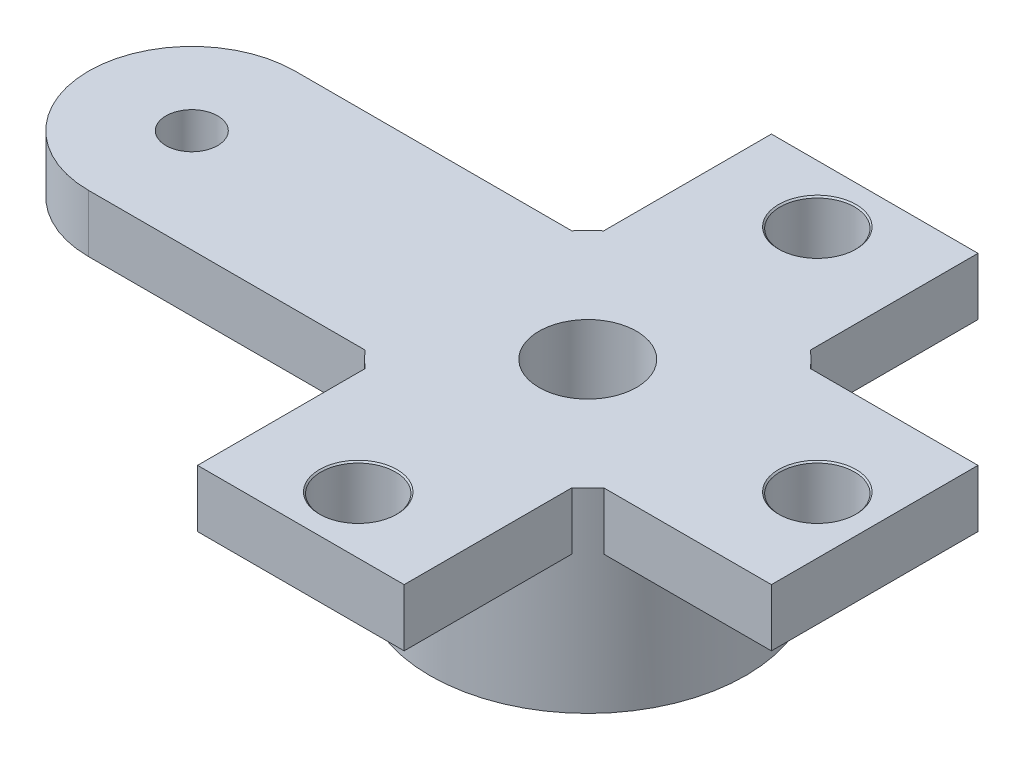
ISO-10303-21;
HEADER;
FILE_DESCRIPTION(('STEP AP214'),'2;1');
FILE_NAME('part.step','',(''),(''),'','','');
FILE_SCHEMA(('AUTOMOTIVE_DESIGN { 1 0 10303 214 1 1 1 1 }'));
ENDSEC;
DATA;
#1=APPLICATION_CONTEXT('core data for automotive mechanical design processes');
#2=APPLICATION_PROTOCOL_DEFINITION('international standard','automotive_design',2000,#1);
#3=PRODUCT_CONTEXT('',#1,'mechanical');
#4=PRODUCT('Part','Part','',(#3));
#5=PRODUCT_RELATED_PRODUCT_CATEGORY('part','',(#4));
#6=PRODUCT_DEFINITION_FORMATION('','',#4);
#7=PRODUCT_DEFINITION_CONTEXT('part definition',#1,'design');
#8=PRODUCT_DEFINITION('design','',#6,#7);
#9=PRODUCT_DEFINITION_SHAPE('','',#8);
#10=(LENGTH_UNIT() NAMED_UNIT(*) SI_UNIT(.MILLI.,.METRE.));
#11=(NAMED_UNIT(*) PLANE_ANGLE_UNIT() SI_UNIT($,.RADIAN.));
#12=(NAMED_UNIT(*) SI_UNIT($,.STERADIAN.) SOLID_ANGLE_UNIT());
#13=UNCERTAINTY_MEASURE_WITH_UNIT(LENGTH_MEASURE(1.E-05),#10,'distance_accuracy_value','');
#14=(GEOMETRIC_REPRESENTATION_CONTEXT(3) GLOBAL_UNCERTAINTY_ASSIGNED_CONTEXT((#13)) GLOBAL_UNIT_ASSIGNED_CONTEXT((#10,
#11,#12)) REPRESENTATION_CONTEXT('',''));
#15=CARTESIAN_POINT('',(0.,0.,0.));
#16=DIRECTION('',(0.,0.,1.));
#17=DIRECTION('',(1.,0.,0.));
#18=AXIS2_PLACEMENT_3D('',#15,#16,#17);
#19=CARTESIAN_POINT('',(-15.9700648039418,2.4,0.481972388439719));
#20=DIRECTION('',(0.,1.,0.));
#21=DIRECTION('',(0.,0.,1.));
#22=AXIS2_PLACEMENT_3D('',#19,#20,#21);
#23=PLANE('',#22);
#24=DIRECTION('',(0.,0.,-1.));
#25=VECTOR('',#24,1.);
#26=CARTESIAN_POINT('',(-1.79999999999997,2.4,0.481972388439679));
#27=LINE('',#26,#25);
#28=CARTESIAN_POINT('',(-1.79999999999998,2.4,-2.0790622886292));
#29=VERTEX_POINT('',#28);
#30=CARTESIAN_POINT('',(-1.79999999999999,2.4,-5.));
#31=VERTEX_POINT('',#30);
#32=EDGE_CURVE('E168',#29,#31,#27,.T.);
#33=ORIENTED_EDGE('',*,*,#32,.T.);
#34=DIRECTION('',(1.,0.,0.));
#35=VECTOR('',#34,1.);
#36=CARTESIAN_POINT('',(-15.9700648039418,2.4,-5.));
#37=LINE('',#36,#35);
#38=CARTESIAN_POINT('',(1.80000000000001,2.4,-5.));
#39=VERTEX_POINT('',#38);
#40=EDGE_CURVE('E11',#31,#39,#37,.T.);
#41=ORIENTED_EDGE('',*,*,#40,.T.);
#42=DIRECTION('',(0.,0.,-1.));
#43=VECTOR('',#42,1.);
#44=CARTESIAN_POINT('',(1.80000000000003,2.4,0.481972388439667));
#45=LINE('',#44,#43);
#46=CARTESIAN_POINT('',(1.80000000000002,2.4,-2.07906228862916));
#47=VERTEX_POINT('',#46);
#48=EDGE_CURVE('E165',#47,#39,#45,.T.);
#49=ORIENTED_EDGE('',*,*,#48,.F.);
#50=CARTESIAN_POINT('',(0.,2.4,0.));
#51=DIRECTION('',(0.,1.,0.));
#52=DIRECTION('',(0.,0.,1.));
#53=AXIS2_PLACEMENT_3D('',#50,#51,#52);
#54=CIRCLE('',#53,2.75);
#55=EDGE_CURVE('E179',#47,#29,#54,.T.);
#56=ORIENTED_EDGE('',*,*,#55,.T.);
#57=EDGE_LOOP('',(#33,#41,#49,#56));
#58=FACE_BOUND('',#57,.T.);
#59=CARTESIAN_POINT('',(0.,2.4,-4.));
#60=DIRECTION('',(0.,-1.,0.));
#61=DIRECTION('',(0.,0.,-1.));
#62=AXIS2_PLACEMENT_3D('',#59,#60,#61);
#63=CIRCLE('',#62,0.675);
#64=CARTESIAN_POINT('',(0.,2.4,-4.675));
#65=VERTEX_POINT('',#64);
#66=EDGE_CURVE('E352',#65,#65,#63,.T.);
#67=ORIENTED_EDGE('',*,*,#66,.F.);
#68=EDGE_LOOP('',(#67));
#69=FACE_BOUND('',#68,.T.);
#70=ADVANCED_FACE('F33',(#58,#69),#23,.F.);
#71=CARTESIAN_POINT('',(-15.9700648039418,2.4,0.481972388439719));
#72=DIRECTION('',(0.,1.,0.));
#73=DIRECTION('',(0.,0.,1.));
#74=AXIS2_PLACEMENT_3D('',#71,#72,#73);
#75=PLANE('',#74);
#76=DIRECTION('',(1.,0.,0.));
#77=VECTOR('',#76,1.);
#78=CARTESIAN_POINT('',(-15.9700648039418,2.4,-1.8));
#79=LINE('',#78,#77);
#80=CARTESIAN_POINT('',(2.07906228862918,2.4,-1.8));
#81=VERTEX_POINT('',#80);
#82=CARTESIAN_POINT('',(5.,2.4,-1.8));
#83=VERTEX_POINT('',#82);
#84=EDGE_CURVE('E267',#81,#83,#79,.T.);
#85=ORIENTED_EDGE('',*,*,#84,.T.);
#86=DIRECTION('',(0.,0.,1.));
#87=VECTOR('',#86,1.);
#88=CARTESIAN_POINT('',(5.,2.4,0.481972388439714));
#89=LINE('',#88,#87);
#90=CARTESIAN_POINT('',(5.,2.4,1.8));
#91=VERTEX_POINT('',#90);
#92=EDGE_CURVE('E224',#83,#91,#89,.T.);
#93=ORIENTED_EDGE('',*,*,#92,.T.);
#94=DIRECTION('',(1.,0.,0.));
#95=VECTOR('',#94,1.);
#96=CARTESIAN_POINT('',(-15.9700648039418,2.4,1.8));
#97=LINE('',#96,#95);
#98=CARTESIAN_POINT('',(2.07906228862918,2.4,1.8));
#99=VERTEX_POINT('',#98);
#100=EDGE_CURVE('E264',#99,#91,#97,.T.);
#101=ORIENTED_EDGE('',*,*,#100,.F.);
#102=CARTESIAN_POINT('',(0.,2.4,0.));
#103=DIRECTION('',(0.,1.,0.));
#104=DIRECTION('',(0.,0.,1.));
#105=AXIS2_PLACEMENT_3D('',#102,#103,#104);
#106=CIRCLE('',#105,2.75);
#107=EDGE_CURVE('E271',#99,#81,#106,.T.);
#108=ORIENTED_EDGE('',*,*,#107,.T.);
#109=EDGE_LOOP('',(#85,#93,#101,#108));
#110=FACE_BOUND('',#109,.T.);
#111=CARTESIAN_POINT('',(4.,2.4,0.));
#112=DIRECTION('',(0.,-1.,0.));
#113=DIRECTION('',(0.,0.,-1.));
#114=AXIS2_PLACEMENT_3D('',#111,#112,#113);
#115=CIRCLE('',#114,0.675);
#116=CARTESIAN_POINT('',(4.,2.4,-0.675));
#117=VERTEX_POINT('',#116);
#118=EDGE_CURVE('E340',#117,#117,#115,.T.);
#119=ORIENTED_EDGE('',*,*,#118,.F.);
#120=EDGE_LOOP('',(#119));
#121=FACE_BOUND('',#120,.T.);
#122=ADVANCED_FACE('F307',(#110,#121),#75,.F.);
#123=CARTESIAN_POINT('',(-15.9700648039418,2.4,0.481972388439719));
#124=DIRECTION('',(0.,1.,0.));
#125=DIRECTION('',(0.,0.,1.));
#126=AXIS2_PLACEMENT_3D('',#123,#124,#125);
#127=PLANE('',#126);
#128=DIRECTION('',(0.,0.,1.));
#129=VECTOR('',#128,1.);
#130=CARTESIAN_POINT('',(1.79999999999999,2.4,0.48197238843972));
#131=LINE('',#130,#129);
#132=CARTESIAN_POINT('',(1.79999999999999,2.4,2.07906228862919));
#133=VERTEX_POINT('',#132);
#134=CARTESIAN_POINT('',(1.79999999999999,2.4,4.99999999999999));
#135=VERTEX_POINT('',#134);
#136=EDGE_CURVE('E239',#133,#135,#131,.T.);
#137=ORIENTED_EDGE('',*,*,#136,.T.);
#138=DIRECTION('',(-1.,0.,0.));
#139=VECTOR('',#138,1.);
#140=CARTESIAN_POINT('',(-15.9700648039418,2.4,4.99999999999999));
#141=LINE('',#140,#139);
#142=CARTESIAN_POINT('',(-1.80000000000001,2.4,4.99999999999999));
#143=VERTEX_POINT('',#142);
#144=EDGE_CURVE('E41',#135,#143,#141,.T.);
#145=ORIENTED_EDGE('',*,*,#144,.T.);
#146=DIRECTION('',(0.,0.,1.));
#147=VECTOR('',#146,1.);
#148=CARTESIAN_POINT('',(-1.8,2.4,0.481972388439737));
#149=LINE('',#148,#147);
#150=CARTESIAN_POINT('',(-1.8,2.4,2.07906228862918));
#151=VERTEX_POINT('',#150);
#152=EDGE_CURVE('E237',#151,#143,#149,.T.);
#153=ORIENTED_EDGE('',*,*,#152,.F.);
#154=CARTESIAN_POINT('',(0.,2.4,0.));
#155=DIRECTION('',(0.,1.,0.));
#156=DIRECTION('',(0.,0.,1.));
#157=AXIS2_PLACEMENT_3D('',#154,#155,#156);
#158=CIRCLE('',#157,2.75);
#159=EDGE_CURVE('E248',#151,#133,#158,.T.);
#160=ORIENTED_EDGE('',*,*,#159,.T.);
#161=EDGE_LOOP('',(#137,#145,#153,#160));
#162=FACE_BOUND('',#161,.T.);
#163=CARTESIAN_POINT('',(0.,2.4,4.));
#164=DIRECTION('',(0.,-1.,0.));
#165=DIRECTION('',(0.,0.,-1.));
#166=AXIS2_PLACEMENT_3D('',#163,#164,#165);
#167=CIRCLE('',#166,0.675);
#168=CARTESIAN_POINT('',(0.,2.4,3.325));
#169=VERTEX_POINT('',#168);
#170=EDGE_CURVE('E328',#169,#169,#167,.T.);
#171=ORIENTED_EDGE('',*,*,#170,.F.);
#172=EDGE_LOOP('',(#171));
#173=FACE_BOUND('',#172,.T.);
#174=ADVANCED_FACE('F234',(#162,#173),#127,.F.);
#175=CARTESIAN_POINT('',(0.,3.4,0.));
#176=DIRECTION('',(0.,1.,0.));
#177=DIRECTION('',(0.,0.,1.));
#178=AXIS2_PLACEMENT_3D('',#175,#176,#177);
#179=PLANE('',#178);
#180=CARTESIAN_POINT('',(0.,3.4,-4.));
#181=DIRECTION('',(0.,-1.,0.));
#182=DIRECTION('',(0.,0.,-1.));
#183=AXIS2_PLACEMENT_3D('',#180,#181,#182);
#184=CIRCLE('',#183,0.675);
#185=CARTESIAN_POINT('',(0.,3.4,-4.675));
#186=VERTEX_POINT('',#185);
#187=EDGE_CURVE('E355',#186,#186,#184,.T.);
#188=ORIENTED_EDGE('',*,*,#187,.T.);
#189=EDGE_LOOP('',(#188));
#190=FACE_BOUND('',#189,.T.);
#191=CARTESIAN_POINT('',(4.,3.4,0.));
#192=DIRECTION('',(0.,-1.,0.));
#193=DIRECTION('',(0.,0.,-1.));
#194=AXIS2_PLACEMENT_3D('',#191,#192,#193);
#195=CIRCLE('',#194,0.674999999999999);
#196=CARTESIAN_POINT('',(4.,3.4,-0.674999999999999));
#197=VERTEX_POINT('',#196);
#198=EDGE_CURVE('E343',#197,#197,#195,.T.);
#199=ORIENTED_EDGE('',*,*,#198,.T.);
#200=EDGE_LOOP('',(#199));
#201=FACE_BOUND('',#200,.T.);
#202=CARTESIAN_POINT('',(0.,3.4,4.));
#203=DIRECTION('',(0.,-1.,0.));
#204=DIRECTION('',(0.,0.,-1.));
#205=AXIS2_PLACEMENT_3D('',#202,#203,#204);
#206=CIRCLE('',#205,0.675);
#207=CARTESIAN_POINT('',(0.,3.4,3.325));
#208=VERTEX_POINT('',#207);
#209=EDGE_CURVE('E331',#208,#208,#206,.T.);
#210=ORIENTED_EDGE('',*,*,#209,.T.);
#211=EDGE_LOOP('',(#210));
#212=FACE_BOUND('',#211,.T.);
#213=DIRECTION('',(1.,0.,0.));
#214=VECTOR('',#213,1.);
#215=CARTESIAN_POINT('',(-15.7617566147468,3.4,-5.));
#216=LINE('',#215,#214);
#217=CARTESIAN_POINT('',(-1.79999999999999,3.4,-5.));
#218=VERTEX_POINT('',#217);
#219=CARTESIAN_POINT('',(1.80000000000001,3.4,-5.));
#220=VERTEX_POINT('',#219);
#221=EDGE_CURVE('E146',#218,#220,#216,.T.);
#222=ORIENTED_EDGE('',*,*,#221,.F.);
#223=DIRECTION('',(0.,0.,-1.));
#224=VECTOR('',#223,1.);
#225=CARTESIAN_POINT('',(-1.79999999999997,3.4,0.481972388439679));
#226=LINE('',#225,#224);
#227=CARTESIAN_POINT('',(-1.79999999999998,3.4,-2.0790622886292));
#228=VERTEX_POINT('',#227);
#229=EDGE_CURVE('E156',#228,#218,#226,.T.);
#230=ORIENTED_EDGE('',*,*,#229,.F.);
#231=CARTESIAN_POINT('',(0.,3.4,0.));
#232=DIRECTION('',(0.,1.,0.));
#233=DIRECTION('',(0.,0.,1.));
#234=AXIS2_PLACEMENT_3D('',#231,#232,#233);
#235=CIRCLE('',#234,2.75);
#236=CARTESIAN_POINT('',(-2.07906228862918,3.4,-1.8));
#237=VERTEX_POINT('',#236);
#238=EDGE_CURVE('E226',#228,#237,#235,.T.);
#239=ORIENTED_EDGE('',*,*,#238,.T.);
#240=DIRECTION('',(-1.,0.,0.));
#241=VECTOR('',#240,1.);
#242=CARTESIAN_POINT('',(-15.9700648039418,3.4,-1.80000000000004));
#243=LINE('',#242,#241);
#244=CARTESIAN_POINT('',(-6.9,3.4,-1.80000000000001));
#245=VERTEX_POINT('',#244);
#246=EDGE_CURVE('E198',#237,#245,#243,.T.);
#247=ORIENTED_EDGE('',*,*,#246,.T.);
#248=CARTESIAN_POINT('',(-6.9,3.4,0.));
#249=DIRECTION('',(0.,1.,0.));
#250=DIRECTION('',(0.,0.,1.));
#251=AXIS2_PLACEMENT_3D('',#248,#249,#250);
#252=CIRCLE('',#251,1.8);
#253=CARTESIAN_POINT('',(-6.9,3.4,1.79999999999999));
#254=VERTEX_POINT('',#253);
#255=EDGE_CURVE('E201',#245,#254,#252,.T.);
#256=ORIENTED_EDGE('',*,*,#255,.T.);
#257=DIRECTION('',(-1.,0.,0.));
#258=VECTOR('',#257,1.);
#259=CARTESIAN_POINT('',(-15.9700648039418,3.4,1.79999999999999));
#260=LINE('',#259,#258);
#261=CARTESIAN_POINT('',(-2.07906228862919,3.4,1.79999999999999));
#262=VERTEX_POINT('',#261);
#263=EDGE_CURVE('E184',#262,#254,#260,.T.);
#264=ORIENTED_EDGE('',*,*,#263,.F.);
#265=CARTESIAN_POINT('',(-1.8,3.4,2.07906228862918));
#266=VERTEX_POINT('',#265);
#267=EDGE_CURVE('E221',#262,#266,#235,.T.);
#268=ORIENTED_EDGE('',*,*,#267,.T.);
#269=DIRECTION('',(0.,0.,1.));
#270=VECTOR('',#269,1.);
#271=CARTESIAN_POINT('',(-1.8,3.4,0.481972388439737));
#272=LINE('',#271,#270);
#273=CARTESIAN_POINT('',(-1.80000000000001,3.4,4.99999999999999));
#274=VERTEX_POINT('',#273);
#275=EDGE_CURVE('E251',#266,#274,#272,.T.);
#276=ORIENTED_EDGE('',*,*,#275,.T.);
#277=DIRECTION('',(-1.,0.,0.));
#278=VECTOR('',#277,1.);
#279=CARTESIAN_POINT('',(-15.7617566147468,3.4,4.99999999999999));
#280=LINE('',#279,#278);
#281=CARTESIAN_POINT('',(1.79999999999999,3.4,4.99999999999999));
#282=VERTEX_POINT('',#281);
#283=EDGE_CURVE('E319',#282,#274,#280,.T.);
#284=ORIENTED_EDGE('',*,*,#283,.F.);
#285=DIRECTION('',(0.,0.,1.));
#286=VECTOR('',#285,1.);
#287=CARTESIAN_POINT('',(1.79999999999999,3.4,0.48197238843972));
#288=LINE('',#287,#286);
#289=CARTESIAN_POINT('',(1.79999999999999,3.4,2.07906228862919));
#290=VERTEX_POINT('',#289);
#291=EDGE_CURVE('E246',#290,#282,#288,.T.);
#292=ORIENTED_EDGE('',*,*,#291,.F.);
#293=CARTESIAN_POINT('',(2.07906228862918,3.4,1.8));
#294=VERTEX_POINT('',#293);
#295=EDGE_CURVE('E225',#290,#294,#235,.T.);
#296=ORIENTED_EDGE('',*,*,#295,.T.);
#297=DIRECTION('',(1.,0.,0.));
#298=VECTOR('',#297,1.);
#299=CARTESIAN_POINT('',(-15.9700648039418,3.4,1.8));
#300=LINE('',#299,#298);
#301=CARTESIAN_POINT('',(5.,3.4,1.8));
#302=VERTEX_POINT('',#301);
#303=EDGE_CURVE('E262',#294,#302,#300,.T.);
#304=ORIENTED_EDGE('',*,*,#303,.T.);
#305=DIRECTION('',(0.,0.,1.));
#306=VECTOR('',#305,1.);
#307=CARTESIAN_POINT('',(5.,3.4,0.477252337699819));
#308=LINE('',#307,#306);
#309=CARTESIAN_POINT('',(5.,3.4,-1.8));
#310=VERTEX_POINT('',#309);
#311=EDGE_CURVE('E314',#310,#302,#308,.T.);
#312=ORIENTED_EDGE('',*,*,#311,.F.);
#313=DIRECTION('',(1.,0.,0.));
#314=VECTOR('',#313,1.);
#315=CARTESIAN_POINT('',(-15.9700648039418,3.4,-1.8));
#316=LINE('',#315,#314);
#317=CARTESIAN_POINT('',(2.07906228862918,3.4,-1.8));
#318=VERTEX_POINT('',#317);
#319=EDGE_CURVE('E268',#318,#310,#316,.T.);
#320=ORIENTED_EDGE('',*,*,#319,.F.);
#321=CARTESIAN_POINT('',(1.80000000000002,3.4,-2.07906228862916));
#322=VERTEX_POINT('',#321);
#323=EDGE_CURVE('E291',#318,#322,#235,.T.);
#324=ORIENTED_EDGE('',*,*,#323,.T.);
#325=DIRECTION('',(0.,0.,-1.));
#326=VECTOR('',#325,1.);
#327=CARTESIAN_POINT('',(1.80000000000003,3.4,0.481972388439667));
#328=LINE('',#327,#326);
#329=EDGE_CURVE('E159',#322,#220,#328,.T.);
#330=ORIENTED_EDGE('',*,*,#329,.T.);
#331=EDGE_LOOP('',(#222,#230,#239,#247,#256,#264,#268,#276,#284,#292,#296,#304,#312,#320,#324,#330));
#332=FACE_BOUND('',#331,.T.);
#333=CARTESIAN_POINT('',(0.,3.4,0.));
#334=DIRECTION('',(0.,1.,0.));
#335=DIRECTION('',(0.,0.,1.));
#336=AXIS2_PLACEMENT_3D('',#333,#334,#335);
#337=CIRCLE('',#336,0.85);
#338=CARTESIAN_POINT('',(0.,3.4,0.85));
#339=VERTEX_POINT('',#338);
#340=EDGE_CURVE('E215',#339,#339,#337,.T.);
#341=ORIENTED_EDGE('',*,*,#340,.F.);
#342=EDGE_LOOP('',(#341));
#343=FACE_BOUND('',#342,.T.);
#344=CARTESIAN_POINT('',(-6.9,3.4,0.));
#345=DIRECTION('',(0.,1.,0.));
#346=DIRECTION('',(0.,0.,1.));
#347=AXIS2_PLACEMENT_3D('',#344,#345,#346);
#348=CIRCLE('',#347,0.45);
#349=CARTESIAN_POINT('',(-6.9,3.4,0.449999999999986));
#350=VERTEX_POINT('',#349);
#351=EDGE_CURVE('E177',#350,#350,#348,.T.);
#352=ORIENTED_EDGE('',*,*,#351,.F.);
#353=EDGE_LOOP('',(#352));
#354=FACE_BOUND('',#353,.T.);
#355=ADVANCED_FACE('F154',(#190,#201,#212,#332,#343,#354),#179,.T.);
#356=CARTESIAN_POINT('',(0.,0.,0.));
#357=DIRECTION('',(0.,1.,0.));
#358=DIRECTION('',(0.,0.,1.));
#359=AXIS2_PLACEMENT_3D('',#356,#357,#358);
#360=PLANE('',#359);
#361=CARTESIAN_POINT('',(0.,0.,0.));
#362=DIRECTION('',(0.,1.,0.));
#363=DIRECTION('',(0.,0.,1.));
#364=AXIS2_PLACEMENT_3D('',#361,#362,#363);
#365=CIRCLE('',#364,2.75);
#366=CARTESIAN_POINT('',(0.,0.,2.75));
#367=VERTEX_POINT('',#366);
#368=EDGE_CURVE('E218',#367,#367,#365,.T.);
#369=ORIENTED_EDGE('',*,*,#368,.F.);
#370=EDGE_LOOP('',(#369));
#371=FACE_BOUND('',#370,.T.);
#372=CARTESIAN_POINT('',(0.,0.,0.));
#373=DIRECTION('',(0.,1.,0.));
#374=DIRECTION('',(0.,0.,1.));
#375=AXIS2_PLACEMENT_3D('',#372,#373,#374);
#376=CIRCLE('',#375,0.85);
#377=CARTESIAN_POINT('',(0.,0.,0.85));
#378=VERTEX_POINT('',#377);
#379=EDGE_CURVE('E209',#378,#378,#376,.T.);
#380=ORIENTED_EDGE('',*,*,#379,.T.);
#381=EDGE_LOOP('',(#380));
#382=FACE_BOUND('',#381,.T.);
#383=ADVANCED_FACE('F419',(#371,#382),#360,.F.);
#384=CARTESIAN_POINT('',(0.,3.4,0.));
#385=DIRECTION('',(0.,-1.,0.));
#386=DIRECTION('',(0.,0.,-1.));
#387=AXIS2_PLACEMENT_3D('',#384,#385,#386);
#388=CYLINDRICAL_SURFACE('',#387,2.75);
#389=ORIENTED_EDGE('',*,*,#159,.F.);
#390=DIRECTION('',(0.,1.,0.));
#391=VECTOR('',#390,1.);
#392=CARTESIAN_POINT('',(-1.8,2.4,2.07906228862918));
#393=LINE('',#392,#391);
#394=EDGE_CURVE('E245',#151,#266,#393,.T.);
#395=ORIENTED_EDGE('',*,*,#394,.T.);
#396=ORIENTED_EDGE('',*,*,#267,.F.);
#397=DIRECTION('',(0.,1.,0.));
#398=VECTOR('',#397,1.);
#399=CARTESIAN_POINT('',(-2.07906228862919,2.4,1.79999999999999));
#400=LINE('',#399,#398);
#401=CARTESIAN_POINT('',(-2.07906228862919,2.4,1.79999999999999));
#402=VERTEX_POINT('',#401);
#403=EDGE_CURVE('E210',#402,#262,#400,.T.);
#404=ORIENTED_EDGE('',*,*,#403,.F.);
#405=CARTESIAN_POINT('',(0.,2.4,0.));
#406=DIRECTION('',(0.,1.,0.));
#407=DIRECTION('',(0.,0.,1.));
#408=AXIS2_PLACEMENT_3D('',#405,#406,#407);
#409=CIRCLE('',#408,2.75);
#410=CARTESIAN_POINT('',(-2.07906228862918,2.4,-1.8));
#411=VERTEX_POINT('',#410);
#412=EDGE_CURVE('E192',#411,#402,#409,.T.);
#413=ORIENTED_EDGE('',*,*,#412,.F.);
#414=DIRECTION('',(0.,1.,0.));
#415=VECTOR('',#414,1.);
#416=CARTESIAN_POINT('',(-2.07906228862918,2.4,-1.8));
#417=LINE('',#416,#415);
#418=EDGE_CURVE('E206',#411,#237,#417,.T.);
#419=ORIENTED_EDGE('',*,*,#418,.T.);
#420=ORIENTED_EDGE('',*,*,#238,.F.);
#421=DIRECTION('',(0.,1.,0.));
#422=VECTOR('',#421,1.);
#423=CARTESIAN_POINT('',(-1.79999999999998,2.4,-2.0790622886292));
#424=LINE('',#423,#422);
#425=EDGE_CURVE('E164',#29,#228,#424,.T.);
#426=ORIENTED_EDGE('',*,*,#425,.F.);
#427=ORIENTED_EDGE('',*,*,#55,.F.);
#428=DIRECTION('',(0.,1.,0.));
#429=VECTOR('',#428,1.);
#430=CARTESIAN_POINT('',(1.80000000000002,2.4,-2.07906228862916));
#431=LINE('',#430,#429);
#432=EDGE_CURVE('E174',#47,#322,#431,.T.);
#433=ORIENTED_EDGE('',*,*,#432,.T.);
#434=ORIENTED_EDGE('',*,*,#323,.F.);
#435=DIRECTION('',(0.,1.,0.));
#436=VECTOR('',#435,1.);
#437=CARTESIAN_POINT('',(2.07906228862918,2.4,-1.8));
#438=LINE('',#437,#436);
#439=EDGE_CURVE('E274',#81,#318,#438,.T.);
#440=ORIENTED_EDGE('',*,*,#439,.F.);
#441=ORIENTED_EDGE('',*,*,#107,.F.);
#442=DIRECTION('',(0.,1.,0.));
#443=VECTOR('',#442,1.);
#444=CARTESIAN_POINT('',(2.07906228862918,2.4,1.8));
#445=LINE('',#444,#443);
#446=EDGE_CURVE('E170',#99,#294,#445,.T.);
#447=ORIENTED_EDGE('',*,*,#446,.T.);
#448=ORIENTED_EDGE('',*,*,#295,.F.);
#449=DIRECTION('',(0.,1.,0.));
#450=VECTOR('',#449,1.);
#451=CARTESIAN_POINT('',(1.79999999999999,2.4,2.07906228862919));
#452=LINE('',#451,#450);
#453=EDGE_CURVE('E258',#133,#290,#452,.T.);
#454=ORIENTED_EDGE('',*,*,#453,.F.);
#455=EDGE_LOOP('',(#389,#395,#396,#404,#413,#419,#420,#426,#427,#433,#434,#440,#441,#447,#448,#454));
#456=FACE_BOUND('',#455,.T.);
#457=ORIENTED_EDGE('',*,*,#368,.T.);
#458=EDGE_LOOP('',(#457));
#459=FACE_BOUND('',#458,.T.);
#460=ADVANCED_FACE('F35',(#456,#459),#388,.T.);
#461=CARTESIAN_POINT('',(0.,3.4,0.));
#462=DIRECTION('',(0.,-1.,0.));
#463=DIRECTION('',(0.,0.,-1.));
#464=AXIS2_PLACEMENT_3D('',#461,#462,#463);
#465=CYLINDRICAL_SURFACE('',#464,0.85);
#466=ORIENTED_EDGE('',*,*,#340,.T.);
#467=EDGE_LOOP('',(#466));
#468=FACE_BOUND('',#467,.T.);
#469=ORIENTED_EDGE('',*,*,#379,.F.);
#470=EDGE_LOOP('',(#469));
#471=FACE_BOUND('',#470,.T.);
#472=ADVANCED_FACE('F410',(#468,#471),#465,.F.);
#473=CARTESIAN_POINT('',(-15.9700648039418,2.4,-1.80000000000004));
#474=DIRECTION('',(0.,0.,-1.));
#475=DIRECTION('',(-1.,0.,0.));
#476=AXIS2_PLACEMENT_3D('',#473,#474,#475);
#477=PLANE('',#476);
#478=ORIENTED_EDGE('',*,*,#246,.F.);
#479=ORIENTED_EDGE('',*,*,#418,.F.);
#480=DIRECTION('',(-1.,0.,0.));
#481=VECTOR('',#480,1.);
#482=CARTESIAN_POINT('',(-15.9700648039418,2.4,-1.80000000000004));
#483=LINE('',#482,#481);
#484=CARTESIAN_POINT('',(-6.9,2.4,-1.80000000000001));
#485=VERTEX_POINT('',#484);
#486=EDGE_CURVE('E183',#411,#485,#483,.T.);
#487=ORIENTED_EDGE('',*,*,#486,.T.);
#488=DIRECTION('',(0.,1.,0.));
#489=VECTOR('',#488,1.);
#490=CARTESIAN_POINT('',(-6.9,2.4,-1.80000000000001));
#491=LINE('',#490,#489);
#492=EDGE_CURVE('E195',#485,#245,#491,.T.);
#493=ORIENTED_EDGE('',*,*,#492,.T.);
#494=EDGE_LOOP('',(#478,#479,#487,#493));
#495=FACE_BOUND('',#494,.T.);
#496=ADVANCED_FACE('F403',(#495),#477,.T.);
#497=CARTESIAN_POINT('',(-15.9700648039418,2.4,1.79999999999999));
#498=DIRECTION('',(0.,0.,-1.));
#499=DIRECTION('',(-1.,0.,0.));
#500=AXIS2_PLACEMENT_3D('',#497,#498,#499);
#501=PLANE('',#500);
#502=ORIENTED_EDGE('',*,*,#263,.T.);
#503=DIRECTION('',(0.,1.,0.));
#504=VECTOR('',#503,1.);
#505=CARTESIAN_POINT('',(-6.9,2.4,1.79999999999999));
#506=LINE('',#505,#504);
#507=CARTESIAN_POINT('',(-6.9,2.4,1.79999999999999));
#508=VERTEX_POINT('',#507);
#509=EDGE_CURVE('E212',#508,#254,#506,.T.);
#510=ORIENTED_EDGE('',*,*,#509,.F.);
#511=DIRECTION('',(-1.,0.,0.));
#512=VECTOR('',#511,1.);
#513=CARTESIAN_POINT('',(-15.9700648039418,2.4,1.79999999999999));
#514=LINE('',#513,#512);
#515=EDGE_CURVE('E190',#402,#508,#514,.T.);
#516=ORIENTED_EDGE('',*,*,#515,.F.);
#517=ORIENTED_EDGE('',*,*,#403,.T.);
#518=EDGE_LOOP('',(#502,#510,#516,#517));
#519=FACE_BOUND('',#518,.T.);
#520=ADVANCED_FACE('F399',(#519),#501,.F.);
#521=CARTESIAN_POINT('',(-6.9,2.4,0.));
#522=DIRECTION('',(0.,1.,0.));
#523=DIRECTION('',(0.,0.,1.));
#524=AXIS2_PLACEMENT_3D('',#521,#522,#523);
#525=CYLINDRICAL_SURFACE('',#524,0.45);
#526=CARTESIAN_POINT('',(-6.9,2.4,0.));
#527=DIRECTION('',(0.,1.,0.));
#528=DIRECTION('',(0.,0.,1.));
#529=AXIS2_PLACEMENT_3D('',#526,#527,#528);
#530=CIRCLE('',#529,0.45);
#531=CARTESIAN_POINT('',(-6.9,2.4,0.449999999999986));
#532=VERTEX_POINT('',#531);
#533=EDGE_CURVE('E180',#532,#532,#530,.T.);
#534=ORIENTED_EDGE('',*,*,#533,.F.);
#535=EDGE_LOOP('',(#534));
#536=FACE_BOUND('',#535,.T.);
#537=ORIENTED_EDGE('',*,*,#351,.T.);
#538=EDGE_LOOP('',(#537));
#539=FACE_BOUND('',#538,.T.);
#540=ADVANCED_FACE('F402',(#536,#539),#525,.F.);
#541=CARTESIAN_POINT('',(-6.9,2.4,0.));
#542=DIRECTION('',(0.,1.,0.));
#543=DIRECTION('',(0.,0.,1.));
#544=AXIS2_PLACEMENT_3D('',#541,#542,#543);
#545=CYLINDRICAL_SURFACE('',#544,1.8);
#546=ORIENTED_EDGE('',*,*,#255,.F.);
#547=ORIENTED_EDGE('',*,*,#492,.F.);
#548=CARTESIAN_POINT('',(-6.9,2.4,0.));
#549=DIRECTION('',(0.,1.,0.));
#550=DIRECTION('',(0.,0.,1.));
#551=AXIS2_PLACEMENT_3D('',#548,#549,#550);
#552=CIRCLE('',#551,1.8);
#553=EDGE_CURVE('E187',#485,#508,#552,.T.);
#554=ORIENTED_EDGE('',*,*,#553,.T.);
#555=ORIENTED_EDGE('',*,*,#509,.T.);
#556=EDGE_LOOP('',(#546,#547,#554,#555));
#557=FACE_BOUND('',#556,.T.);
#558=ADVANCED_FACE('F397',(#557),#545,.T.);
#559=CARTESIAN_POINT('',(-15.9700648039418,2.4,0.481972388439719));
#560=DIRECTION('',(0.,1.,0.));
#561=DIRECTION('',(0.,0.,1.));
#562=AXIS2_PLACEMENT_3D('',#559,#560,#561);
#563=PLANE('',#562);
#564=ORIENTED_EDGE('',*,*,#533,.T.);
#565=EDGE_LOOP('',(#564));
#566=FACE_BOUND('',#565,.T.);
#567=ORIENTED_EDGE('',*,*,#486,.F.);
#568=ORIENTED_EDGE('',*,*,#412,.T.);
#569=ORIENTED_EDGE('',*,*,#515,.T.);
#570=ORIENTED_EDGE('',*,*,#553,.F.);
#571=EDGE_LOOP('',(#567,#568,#569,#570));
#572=FACE_BOUND('',#571,.T.);
#573=ADVANCED_FACE('F393',(#566,#572),#563,.F.);
#574=CARTESIAN_POINT('',(1.80000000000003,2.4,0.481972388439667));
#575=DIRECTION('',(1.,0.,0.));
#576=DIRECTION('',(0.,0.,-1.));
#577=AXIS2_PLACEMENT_3D('',#574,#575,#576);
#578=PLANE('',#577);
#579=DIRECTION('',(0.,1.,0.));
#580=VECTOR('',#579,1.);
#581=CARTESIAN_POINT('',(1.80000000000001,0.,-5.));
#582=LINE('',#581,#580);
#583=EDGE_CURVE('E48',#39,#220,#582,.T.);
#584=ORIENTED_EDGE('',*,*,#583,.T.);
#585=ORIENTED_EDGE('',*,*,#329,.F.);
#586=ORIENTED_EDGE('',*,*,#432,.F.);
#587=ORIENTED_EDGE('',*,*,#48,.T.);
#588=EDGE_LOOP('',(#584,#585,#586,#587));
#589=FACE_BOUND('',#588,.T.);
#590=ADVANCED_FACE('F390',(#589),#578,.T.);
#591=CARTESIAN_POINT('',(-1.79999999999997,2.4,0.481972388439679));
#592=DIRECTION('',(1.,0.,0.));
#593=DIRECTION('',(0.,0.,-1.));
#594=AXIS2_PLACEMENT_3D('',#591,#592,#593);
#595=PLANE('',#594);
#596=ORIENTED_EDGE('',*,*,#229,.T.);
#597=DIRECTION('',(0.,1.,0.));
#598=VECTOR('',#597,1.);
#599=CARTESIAN_POINT('',(-1.79999999999999,0.,-5.));
#600=LINE('',#599,#598);
#601=EDGE_CURVE('E143',#31,#218,#600,.T.);
#602=ORIENTED_EDGE('',*,*,#601,.F.);
#603=ORIENTED_EDGE('',*,*,#32,.F.);
#604=ORIENTED_EDGE('',*,*,#425,.T.);
#605=EDGE_LOOP('',(#596,#602,#603,#604));
#606=FACE_BOUND('',#605,.T.);
#607=ADVANCED_FACE('F162',(#606),#595,.F.);
#608=CARTESIAN_POINT('',(-15.9700648039418,2.4,1.8));
#609=DIRECTION('',(0.,0.,1.));
#610=DIRECTION('',(1.,0.,0.));
#611=AXIS2_PLACEMENT_3D('',#608,#609,#610);
#612=PLANE('',#611);
#613=DIRECTION('',(0.,1.,0.));
#614=VECTOR('',#613,1.);
#615=CARTESIAN_POINT('',(5.,0.,1.8));
#616=LINE('',#615,#614);
#617=EDGE_CURVE('E259',#91,#302,#616,.T.);
#618=ORIENTED_EDGE('',*,*,#617,.T.);
#619=ORIENTED_EDGE('',*,*,#303,.F.);
#620=ORIENTED_EDGE('',*,*,#446,.F.);
#621=ORIENTED_EDGE('',*,*,#100,.T.);
#622=EDGE_LOOP('',(#618,#619,#620,#621));
#623=FACE_BOUND('',#622,.T.);
#624=ADVANCED_FACE('F302',(#623),#612,.T.);
#625=CARTESIAN_POINT('',(-15.9700648039418,2.4,-1.8));
#626=DIRECTION('',(0.,0.,1.));
#627=DIRECTION('',(1.,0.,0.));
#628=AXIS2_PLACEMENT_3D('',#625,#626,#627);
#629=PLANE('',#628);
#630=ORIENTED_EDGE('',*,*,#319,.T.);
#631=DIRECTION('',(0.,1.,0.));
#632=VECTOR('',#631,1.);
#633=CARTESIAN_POINT('',(5.,0.,-1.8));
#634=LINE('',#633,#632);
#635=EDGE_CURVE('E254',#83,#310,#634,.T.);
#636=ORIENTED_EDGE('',*,*,#635,.F.);
#637=ORIENTED_EDGE('',*,*,#84,.F.);
#638=ORIENTED_EDGE('',*,*,#439,.T.);
#639=EDGE_LOOP('',(#630,#636,#637,#638));
#640=FACE_BOUND('',#639,.T.);
#641=ADVANCED_FACE('F313',(#640),#629,.F.);
#642=CARTESIAN_POINT('',(-1.8,2.4,0.481972388439737));
#643=DIRECTION('',(-1.,0.,0.));
#644=DIRECTION('',(0.,0.,1.));
#645=AXIS2_PLACEMENT_3D('',#642,#643,#644);
#646=PLANE('',#645);
#647=DIRECTION('',(0.,1.,0.));
#648=VECTOR('',#647,1.);
#649=CARTESIAN_POINT('',(-1.80000000000001,0.,4.99999999999999));
#650=LINE('',#649,#648);
#651=EDGE_CURVE('E55',#143,#274,#650,.T.);
#652=ORIENTED_EDGE('',*,*,#651,.T.);
#653=ORIENTED_EDGE('',*,*,#275,.F.);
#654=ORIENTED_EDGE('',*,*,#394,.F.);
#655=ORIENTED_EDGE('',*,*,#152,.T.);
#656=EDGE_LOOP('',(#652,#653,#654,#655));
#657=FACE_BOUND('',#656,.T.);
#658=ADVANCED_FACE('F242',(#657),#646,.T.);
#659=CARTESIAN_POINT('',(1.79999999999999,2.4,0.48197238843972));
#660=DIRECTION('',(-1.,0.,0.));
#661=DIRECTION('',(0.,0.,1.));
#662=AXIS2_PLACEMENT_3D('',#659,#660,#661);
#663=PLANE('',#662);
#664=ORIENTED_EDGE('',*,*,#291,.T.);
#665=DIRECTION('',(0.,1.,0.));
#666=VECTOR('',#665,1.);
#667=CARTESIAN_POINT('',(1.79999999999999,0.,4.99999999999999));
#668=LINE('',#667,#666);
#669=EDGE_CURVE('E316',#135,#282,#668,.T.);
#670=ORIENTED_EDGE('',*,*,#669,.F.);
#671=ORIENTED_EDGE('',*,*,#136,.F.);
#672=ORIENTED_EDGE('',*,*,#453,.T.);
#673=EDGE_LOOP('',(#664,#670,#671,#672));
#674=FACE_BOUND('',#673,.T.);
#675=ADVANCED_FACE('F479',(#674),#663,.F.);
#676=CARTESIAN_POINT('',(5.,0.,0.477252337699819));
#677=DIRECTION('',(-1.,0.,0.));
#678=DIRECTION('',(0.,0.,1.));
#679=AXIS2_PLACEMENT_3D('',#676,#677,#678);
#680=PLANE('',#679);
#681=ORIENTED_EDGE('',*,*,#635,.T.);
#682=ORIENTED_EDGE('',*,*,#311,.T.);
#683=ORIENTED_EDGE('',*,*,#617,.F.);
#684=ORIENTED_EDGE('',*,*,#92,.F.);
#685=EDGE_LOOP('',(#681,#682,#683,#684));
#686=FACE_BOUND('',#685,.T.);
#687=ADVANCED_FACE('F311',(#686),#680,.F.);
#688=CARTESIAN_POINT('',(-15.7617566147468,0.,4.99999999999999));
#689=DIRECTION('',(0.,0.,-1.));
#690=DIRECTION('',(-1.,0.,0.));
#691=AXIS2_PLACEMENT_3D('',#688,#689,#690);
#692=PLANE('',#691);
#693=ORIENTED_EDGE('',*,*,#669,.T.);
#694=ORIENTED_EDGE('',*,*,#283,.T.);
#695=ORIENTED_EDGE('',*,*,#651,.F.);
#696=ORIENTED_EDGE('',*,*,#144,.F.);
#697=EDGE_LOOP('',(#693,#694,#695,#696));
#698=FACE_BOUND('',#697,.T.);
#699=ADVANCED_FACE('F493',(#698),#692,.F.);
#700=CARTESIAN_POINT('',(-15.7617566147468,0.,-5.));
#701=DIRECTION('',(0.,0.,1.));
#702=DIRECTION('',(1.,0.,0.));
#703=AXIS2_PLACEMENT_3D('',#700,#701,#702);
#704=PLANE('',#703);
#705=ORIENTED_EDGE('',*,*,#601,.T.);
#706=ORIENTED_EDGE('',*,*,#221,.T.);
#707=ORIENTED_EDGE('',*,*,#583,.F.);
#708=ORIENTED_EDGE('',*,*,#40,.F.);
#709=EDGE_LOOP('',(#705,#706,#707,#708));
#710=FACE_BOUND('',#709,.T.);
#711=ADVANCED_FACE('F145',(#710),#704,.F.);
#712=CARTESIAN_POINT('',(0.,3.375,4.));
#713=DIRECTION('',(0.,1.,0.));
#714=DIRECTION('',(0.,0.,1.));
#715=AXIS2_PLACEMENT_3D('',#712,#713,#714);
#716=CONICAL_SURFACE('',#715,0.65,0.785398163397448);
#717=ORIENTED_EDGE('',*,*,#209,.F.);
#718=EDGE_LOOP('',(#717));
#719=FACE_BOUND('',#718,.T.);
#720=CARTESIAN_POINT('',(0.,3.375,4.));
#721=DIRECTION('',(0.,-1.,0.));
#722=DIRECTION('',(0.,0.,-1.));
#723=AXIS2_PLACEMENT_3D('',#720,#721,#722);
#724=CIRCLE('',#723,0.65);
#725=CARTESIAN_POINT('',(0.,3.375,3.35));
#726=VERTEX_POINT('',#725);
#727=EDGE_CURVE('E160',#726,#726,#724,.T.);
#728=ORIENTED_EDGE('',*,*,#727,.T.);
#729=EDGE_LOOP('',(#728));
#730=FACE_BOUND('',#729,.T.);
#731=ADVANCED_FACE('F506',(#719,#730),#716,.F.);
#732=CARTESIAN_POINT('',(0.,2.4,4.));
#733=DIRECTION('',(0.,-1.,0.));
#734=DIRECTION('',(0.,0.,-1.));
#735=AXIS2_PLACEMENT_3D('',#732,#733,#734);
#736=CYLINDRICAL_SURFACE('',#735,0.65);
#737=ORIENTED_EDGE('',*,*,#727,.F.);
#738=EDGE_LOOP('',(#737));
#739=FACE_BOUND('',#738,.T.);
#740=CARTESIAN_POINT('',(0.,2.425,4.));
#741=DIRECTION('',(0.,-1.,0.));
#742=DIRECTION('',(0.,0.,-1.));
#743=AXIS2_PLACEMENT_3D('',#740,#741,#742);
#744=CIRCLE('',#743,0.65);
#745=CARTESIAN_POINT('',(0.,2.425,3.35));
#746=VERTEX_POINT('',#745);
#747=EDGE_CURVE('E325',#746,#746,#744,.T.);
#748=ORIENTED_EDGE('',*,*,#747,.T.);
#749=EDGE_LOOP('',(#748));
#750=FACE_BOUND('',#749,.T.);
#751=ADVANCED_FACE('F513',(#739,#750),#736,.F.);
#752=CARTESIAN_POINT('',(0.,2.4,4.));
#753=DIRECTION('',(0.,-1.,0.));
#754=DIRECTION('',(0.,0.,-1.));
#755=AXIS2_PLACEMENT_3D('',#752,#753,#754);
#756=CONICAL_SURFACE('',#755,0.675,0.78539816339742);
#757=ORIENTED_EDGE('',*,*,#747,.F.);
#758=EDGE_LOOP('',(#757));
#759=FACE_BOUND('',#758,.T.);
#760=ORIENTED_EDGE('',*,*,#170,.T.);
#761=EDGE_LOOP('',(#760));
#762=FACE_BOUND('',#761,.T.);
#763=ADVANCED_FACE('F522',(#759,#762),#756,.F.);
#764=CARTESIAN_POINT('',(4.,3.375,0.));
#765=DIRECTION('',(0.,1.,0.));
#766=DIRECTION('',(0.,0.,1.));
#767=AXIS2_PLACEMENT_3D('',#764,#765,#766);
#768=CONICAL_SURFACE('',#767,0.65,0.785398163397448);
#769=ORIENTED_EDGE('',*,*,#198,.F.);
#770=EDGE_LOOP('',(#769));
#771=FACE_BOUND('',#770,.T.);
#772=CARTESIAN_POINT('',(4.,3.375,0.));
#773=DIRECTION('',(0.,-1.,0.));
#774=DIRECTION('',(0.,0.,-1.));
#775=AXIS2_PLACEMENT_3D('',#772,#773,#774);
#776=CIRCLE('',#775,0.65);
#777=CARTESIAN_POINT('',(4.,3.375,-0.65));
#778=VERTEX_POINT('',#777);
#779=EDGE_CURVE('E334',#778,#778,#776,.T.);
#780=ORIENTED_EDGE('',*,*,#779,.T.);
#781=EDGE_LOOP('',(#780));
#782=FACE_BOUND('',#781,.T.);
#783=ADVANCED_FACE('F530',(#771,#782),#768,.F.);
#784=CARTESIAN_POINT('',(4.,2.4,0.));
#785=DIRECTION('',(0.,-1.,0.));
#786=DIRECTION('',(0.,0.,-1.));
#787=AXIS2_PLACEMENT_3D('',#784,#785,#786);
#788=CYLINDRICAL_SURFACE('',#787,0.65);
#789=ORIENTED_EDGE('',*,*,#779,.F.);
#790=EDGE_LOOP('',(#789));
#791=FACE_BOUND('',#790,.T.);
#792=CARTESIAN_POINT('',(4.,2.425,0.));
#793=DIRECTION('',(0.,-1.,0.));
#794=DIRECTION('',(0.,0.,-1.));
#795=AXIS2_PLACEMENT_3D('',#792,#793,#794);
#796=CIRCLE('',#795,0.65);
#797=CARTESIAN_POINT('',(4.,2.425,-0.65));
#798=VERTEX_POINT('',#797);
#799=EDGE_CURVE('E337',#798,#798,#796,.T.);
#800=ORIENTED_EDGE('',*,*,#799,.T.);
#801=EDGE_LOOP('',(#800));
#802=FACE_BOUND('',#801,.T.);
#803=ADVANCED_FACE('F538',(#791,#802),#788,.F.);
#804=CARTESIAN_POINT('',(4.,2.4,0.));
#805=DIRECTION('',(0.,-1.,0.));
#806=DIRECTION('',(0.,0.,-1.));
#807=AXIS2_PLACEMENT_3D('',#804,#805,#806);
#808=CONICAL_SURFACE('',#807,0.675,0.785398163397414);
#809=ORIENTED_EDGE('',*,*,#799,.F.);
#810=EDGE_LOOP('',(#809));
#811=FACE_BOUND('',#810,.T.);
#812=ORIENTED_EDGE('',*,*,#118,.T.);
#813=EDGE_LOOP('',(#812));
#814=FACE_BOUND('',#813,.T.);
#815=ADVANCED_FACE('F365',(#811,#814),#808,.F.);
#816=CARTESIAN_POINT('',(0.,3.375,-4.));
#817=DIRECTION('',(0.,1.,0.));
#818=DIRECTION('',(0.,0.,1.));
#819=AXIS2_PLACEMENT_3D('',#816,#817,#818);
#820=CONICAL_SURFACE('',#819,0.65,0.785398163397448);
#821=ORIENTED_EDGE('',*,*,#187,.F.);
#822=EDGE_LOOP('',(#821));
#823=FACE_BOUND('',#822,.T.);
#824=CARTESIAN_POINT('',(0.,3.375,-4.));
#825=DIRECTION('',(0.,-1.,0.));
#826=DIRECTION('',(0.,0.,-1.));
#827=AXIS2_PLACEMENT_3D('',#824,#825,#826);
#828=CIRCLE('',#827,0.65);
#829=CARTESIAN_POINT('',(0.,3.375,-4.65));
#830=VERTEX_POINT('',#829);
#831=EDGE_CURVE('E346',#830,#830,#828,.T.);
#832=ORIENTED_EDGE('',*,*,#831,.T.);
#833=EDGE_LOOP('',(#832));
#834=FACE_BOUND('',#833,.T.);
#835=ADVANCED_FACE('F361',(#823,#834),#820,.F.);
#836=CARTESIAN_POINT('',(0.,2.4,-4.));
#837=DIRECTION('',(0.,-1.,0.));
#838=DIRECTION('',(0.,0.,-1.));
#839=AXIS2_PLACEMENT_3D('',#836,#837,#838);
#840=CYLINDRICAL_SURFACE('',#839,0.65);
#841=ORIENTED_EDGE('',*,*,#831,.F.);
#842=EDGE_LOOP('',(#841));
#843=FACE_BOUND('',#842,.T.);
#844=CARTESIAN_POINT('',(0.,2.425,-4.));
#845=DIRECTION('',(0.,-1.,0.));
#846=DIRECTION('',(0.,0.,-1.));
#847=AXIS2_PLACEMENT_3D('',#844,#845,#846);
#848=CIRCLE('',#847,0.65);
#849=CARTESIAN_POINT('',(0.,2.425,-4.65));
#850=VERTEX_POINT('',#849);
#851=EDGE_CURVE('E349',#850,#850,#848,.T.);
#852=ORIENTED_EDGE('',*,*,#851,.T.);
#853=EDGE_LOOP('',(#852));
#854=FACE_BOUND('',#853,.T.);
#855=ADVANCED_FACE('F364',(#843,#854),#840,.F.);
#856=CARTESIAN_POINT('',(0.,2.4,-4.));
#857=DIRECTION('',(0.,-1.,0.));
#858=DIRECTION('',(0.,0.,-1.));
#859=AXIS2_PLACEMENT_3D('',#856,#857,#858);
#860=CONICAL_SURFACE('',#859,0.675,0.78539816339742);
#861=ORIENTED_EDGE('',*,*,#851,.F.);
#862=EDGE_LOOP('',(#861));
#863=FACE_BOUND('',#862,.T.);
#864=ORIENTED_EDGE('',*,*,#66,.T.);
#865=EDGE_LOOP('',(#864));
#866=FACE_BOUND('',#865,.T.);
#867=ADVANCED_FACE('F371',(#863,#866),#860,.F.);
#868=CLOSED_SHELL('',(#70,#122,#174,#355,#383,#460,#472,#496,#520,#540,#558,#573,#590,#607,#624,
#641,#658,#675,#687,#699,#711,#731,#751,#763,#783,#803,#815,#835,#855,#867));
#869=MANIFOLD_SOLID_BREP('B2',#868);
#870=ADVANCED_BREP_SHAPE_REPRESENTATION('',(#18,#869),#14);
#871=SHAPE_DEFINITION_REPRESENTATION(#9,#870);
ENDSEC;
END-ISO-10303-21;
